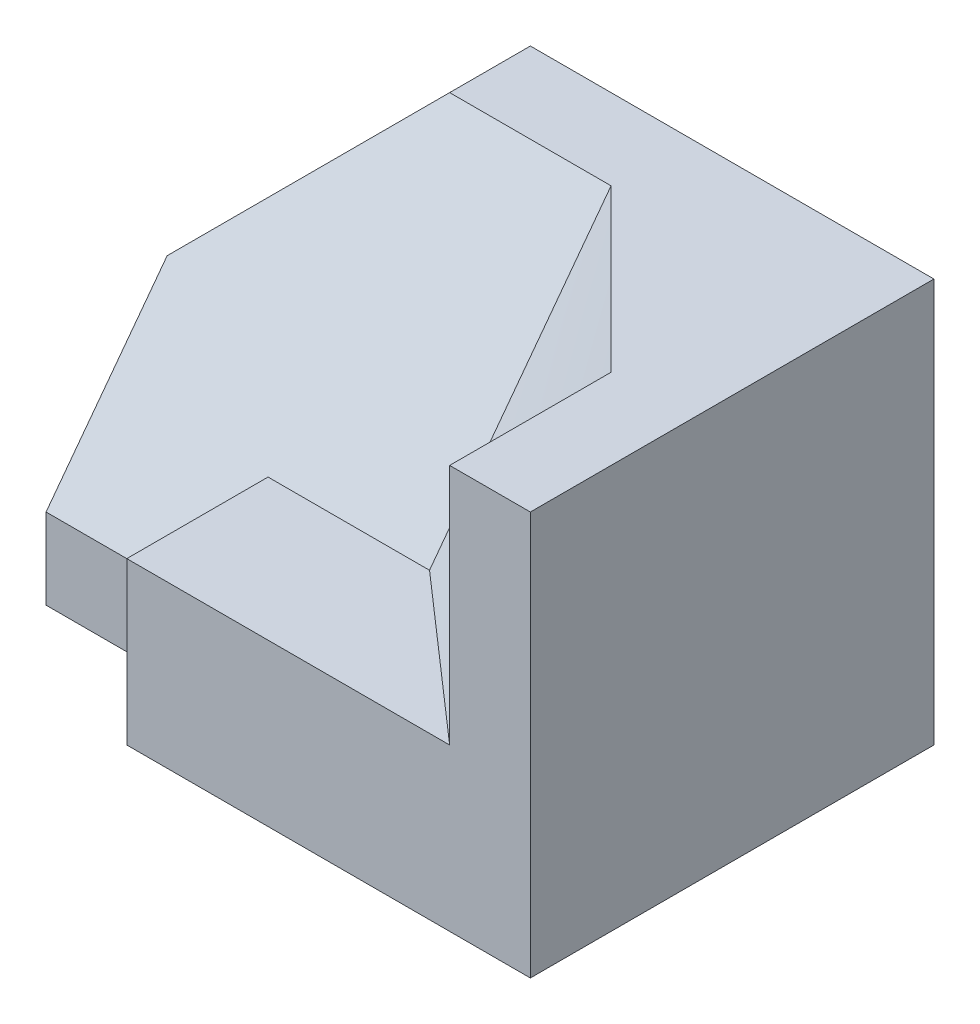
ISO-10303-21;
HEADER;
FILE_DESCRIPTION(('STEP AP214'),'2;1');
FILE_NAME('part.step','',(''),(''),'','','');
FILE_SCHEMA(('AUTOMOTIVE_DESIGN { 1 0 10303 214 1 1 1 1 }'));
ENDSEC;
DATA;
#1=APPLICATION_CONTEXT('core data for automotive mechanical design processes');
#2=APPLICATION_PROTOCOL_DEFINITION('international standard','automotive_design',2000,#1);
#3=PRODUCT_CONTEXT('',#1,'mechanical');
#4=PRODUCT('Part','Part','',(#3));
#5=PRODUCT_RELATED_PRODUCT_CATEGORY('part','',(#4));
#6=PRODUCT_DEFINITION_FORMATION('','',#4);
#7=PRODUCT_DEFINITION_CONTEXT('part definition',#1,'design');
#8=PRODUCT_DEFINITION('design','',#6,#7);
#9=PRODUCT_DEFINITION_SHAPE('','',#8);
#10=(LENGTH_UNIT() NAMED_UNIT(*) SI_UNIT(.MILLI.,.METRE.));
#11=(NAMED_UNIT(*) PLANE_ANGLE_UNIT() SI_UNIT($,.RADIAN.));
#12=(NAMED_UNIT(*) SI_UNIT($,.STERADIAN.) SOLID_ANGLE_UNIT());
#13=UNCERTAINTY_MEASURE_WITH_UNIT(LENGTH_MEASURE(1.E-05),#10,'distance_accuracy_value','');
#14=(GEOMETRIC_REPRESENTATION_CONTEXT(3) GLOBAL_UNCERTAINTY_ASSIGNED_CONTEXT((#13)) GLOBAL_UNIT_ASSIGNED_CONTEXT((#10,
#11,#12)) REPRESENTATION_CONTEXT('',''));
#15=CARTESIAN_POINT('',(0.,0.,0.));
#16=DIRECTION('',(0.,0.,1.));
#17=DIRECTION('',(1.,0.,0.));
#18=AXIS2_PLACEMENT_3D('',#15,#16,#17);
#19=CARTESIAN_POINT('',(3.5,-2.5,5.));
#20=DIRECTION('',(-1.,0.,0.));
#21=DIRECTION('',(0.,0.,1.));
#22=AXIS2_PLACEMENT_3D('',#19,#20,#21);
#23=PLANE('',#22);
#24=DIRECTION('',(0.,1.,0.));
#25=VECTOR('',#24,1.);
#26=CARTESIAN_POINT('',(3.5,-2.5,0.));
#27=LINE('',#26,#25);
#28=CARTESIAN_POINT('',(3.5,-2.5,0.));
#29=VERTEX_POINT('',#28);
#30=CARTESIAN_POINT('',(3.5,2.5,0.));
#31=VERTEX_POINT('',#30);
#32=EDGE_CURVE('E94',#29,#31,#27,.T.);
#33=ORIENTED_EDGE('',*,*,#32,.T.);
#34=DIRECTION('',(0.,0.,-1.));
#35=VECTOR('',#34,1.);
#36=CARTESIAN_POINT('',(3.5,2.5,5.));
#37=LINE('',#36,#35);
#38=CARTESIAN_POINT('',(3.5,2.5,5.));
#39=VERTEX_POINT('',#38);
#40=EDGE_CURVE('E11',#39,#31,#37,.T.);
#41=ORIENTED_EDGE('',*,*,#40,.F.);
#42=DIRECTION('',(0.,1.,0.));
#43=VECTOR('',#42,1.);
#44=CARTESIAN_POINT('',(3.5,-2.5,5.));
#45=LINE('',#44,#43);
#46=CARTESIAN_POINT('',(3.5,-2.5,5.));
#47=VERTEX_POINT('',#46);
#48=EDGE_CURVE('E88',#47,#39,#45,.T.);
#49=ORIENTED_EDGE('',*,*,#48,.F.);
#50=DIRECTION('',(0.,0.,-1.));
#51=VECTOR('',#50,1.);
#52=CARTESIAN_POINT('',(3.5,-2.5,5.));
#53=LINE('',#52,#51);
#54=EDGE_CURVE('E79',#47,#29,#53,.T.);
#55=ORIENTED_EDGE('',*,*,#54,.T.);
#56=EDGE_LOOP('',(#33,#41,#49,#55));
#57=FACE_BOUND('',#56,.T.);
#58=ADVANCED_FACE('F33',(#57),#23,.F.);
#59=CARTESIAN_POINT('',(-1.5,2.5,5.));
#60=DIRECTION('',(0.,-1.,0.));
#61=DIRECTION('',(0.,0.,-1.));
#62=AXIS2_PLACEMENT_3D('',#59,#60,#61);
#63=PLANE('',#62);
#64=DIRECTION('',(-1.,0.,0.));
#65=VECTOR('',#64,1.);
#66=CARTESIAN_POINT('',(0.5,2.5,1.));
#67=LINE('',#66,#65);
#68=CARTESIAN_POINT('',(0.499991235425581,2.50000662214534,1.00002003976787));
#69=VERTEX_POINT('',#68);
#70=CARTESIAN_POINT('',(-1.5,2.5,1.));
#71=VERTEX_POINT('',#70);
#72=EDGE_CURVE('E121',#69,#71,#67,.T.);
#73=ORIENTED_EDGE('',*,*,#72,.F.);
#74=CARTESIAN_POINT('',(2.50056026393935,2.49957668946805,2.99940238513136));
#75=CARTESIAN_POINT('',(2.4170043884305,2.49974362794372,2.91630313545304));
#76=CARTESIAN_POINT('',(2.33350648577593,2.49986806083446,2.83314559335253));
#77=CARTESIAN_POINT('',(2.16659707572382,2.50005165014215,2.66673835405384));
#78=CARTESIAN_POINT('',(2.08318557121702,2.50011080444127,2.58348865395344));
#79=CARTESIAN_POINT('',(1.91642286921159,2.50018356384401,2.41692497031433));
#80=CARTESIAN_POINT('',(1.83307167317345,2.50019716787918,2.33361098531356));
#81=CARTESIAN_POINT('',(1.66640279858282,2.5001990420842,2.16694723722489));
#82=CARTESIAN_POINT('',(1.58308512050144,2.50018731190961,2.08359747366595));
#83=CARTESIAN_POINT('',(1.41645979373729,2.50015624466314,1.91688716884527));
#84=CARTESIAN_POINT('',(1.33315214510184,2.50013690755667,1.83352662753625));
#85=CARTESIAN_POINT('',(1.16653062517446,2.50010289131271,1.66681206317689));
#86=CARTESIAN_POINT('',(1.08321675389405,2.50008821216681,1.58345804011504));
#87=CARTESIAN_POINT('',(0.916576667949463,2.50006811271476,1.41676297625748));
#88=CARTESIAN_POINT('',(0.833250453334195,2.50006269237286,1.33342193541289));
#89=CARTESIAN_POINT('',(0.666595657226337,2.50005363999642,1.166742378393));
#90=CARTESIAN_POINT('',(0.583267075736072,2.50005000796018,1.0834038622154));
#91=CARTESIAN_POINT('',(0.49994238070798,2.50004353487126,1.00006146138524));
#92=B_SPLINE_CURVE_WITH_KNOTS('',3,(#74,#75,#76,#77,#78,#79,#80,#81,#82,#83,#84,#85,#86,#87,#88,
#89,#90,#91),.UNSPECIFIED.,.F.,.F.,(4,2,2,2,2,2,2,2,4),(0.,0.35353046862066,0.707072406602181,
1.06062263744386,1.41417767518168,1.76773432056764,2.12129032681654,2.47484496762246,
2.82839927245548),.UNSPECIFIED.);
#93=CARTESIAN_POINT('',(2.50047933076574,2.49988586347262,2.99950157618049));
#94=VERTEX_POINT('',#93);
#95=EDGE_CURVE('E149',#94,#69,#92,.T.);
#96=ORIENTED_EDGE('',*,*,#95,.F.);
#97=DIRECTION('',(0.,0.,-1.));
#98=VECTOR('',#97,1.);
#99=CARTESIAN_POINT('',(2.5,2.5,3.));
#100=LINE('',#99,#98);
#101=CARTESIAN_POINT('',(2.5,2.5,5.));
#102=VERTEX_POINT('',#101);
#103=EDGE_CURVE('E134',#102,#94,#100,.T.);
#104=ORIENTED_EDGE('',*,*,#103,.F.);
#105=DIRECTION('',(-1.,0.,0.));
#106=VECTOR('',#105,1.);
#107=CARTESIAN_POINT('',(-1.5,2.5,5.));
#108=LINE('',#107,#106);
#109=EDGE_CURVE('E281',#39,#102,#108,.T.);
#110=ORIENTED_EDGE('',*,*,#109,.F.);
#111=ORIENTED_EDGE('',*,*,#40,.T.);
#112=DIRECTION('',(-1.,0.,0.));
#113=VECTOR('',#112,1.);
#114=CARTESIAN_POINT('',(-1.5,2.5,0.));
#115=LINE('',#114,#113);
#116=CARTESIAN_POINT('',(-1.5,2.5,0.));
#117=VERTEX_POINT('',#116);
#118=EDGE_CURVE('E99',#31,#117,#115,.T.);
#119=ORIENTED_EDGE('',*,*,#118,.T.);
#120=DIRECTION('',(0.,0.,-1.));
#121=VECTOR('',#120,1.);
#122=CARTESIAN_POINT('',(-1.5,2.5,5.));
#123=LINE('',#122,#121);
#124=EDGE_CURVE('E44',#71,#117,#123,.T.);
#125=ORIENTED_EDGE('',*,*,#124,.F.);
#126=EDGE_LOOP('',(#73,#96,#104,#110,#111,#119,#125));
#127=FACE_BOUND('',#126,.T.);
#128=ADVANCED_FACE('F155',(#127),#63,.F.);
#129=CARTESIAN_POINT('',(-3.5,0.5,5.));
#130=DIRECTION('',(0.707106781186548,-0.707106781186548,0.));
#131=DIRECTION('',(0.707106781186548,0.707106781186548,0.));
#132=AXIS2_PLACEMENT_3D('',#129,#130,#131);
#133=PLANE('',#132);
#134=DIRECTION('',(0.,0.,-1.));
#135=VECTOR('',#134,1.);
#136=CARTESIAN_POINT('',(-3.5,0.5,5.));
#137=LINE('',#136,#135);
#138=CARTESIAN_POINT('',(-3.5,0.5,2.5));
#139=VERTEX_POINT('',#138);
#140=CARTESIAN_POINT('',(-3.5,0.5,0.));
#141=VERTEX_POINT('',#140);
#142=EDGE_CURVE('E114',#139,#141,#137,.T.);
#143=ORIENTED_EDGE('',*,*,#142,.F.);
#144=DIRECTION('',(0.624695047554424,0.624695047554424,-0.468521285665818));
#145=VECTOR('',#144,1.);
#146=CARTESIAN_POINT('',(-4.23170731707317,-0.23170731707317,3.04878048780488));
#147=LINE('',#146,#145);
#148=EDGE_CURVE('E135',#139,#71,#147,.T.);
#149=ORIENTED_EDGE('',*,*,#148,.T.);
#150=ORIENTED_EDGE('',*,*,#124,.T.);
#151=DIRECTION('',(-0.707106781186548,-0.707106781186548,0.));
#152=VECTOR('',#151,1.);
#153=CARTESIAN_POINT('',(-3.5,0.5,0.));
#154=LINE('',#153,#152);
#155=EDGE_CURVE('E102',#117,#141,#154,.T.);
#156=ORIENTED_EDGE('',*,*,#155,.T.);
#157=EDGE_LOOP('',(#143,#149,#150,#156));
#158=FACE_BOUND('',#157,.T.);
#159=ADVANCED_FACE('F164',(#158),#133,.F.);
#160=CARTESIAN_POINT('',(-3.5,-2.5,5.));
#161=DIRECTION('',(1.,0.,0.));
#162=DIRECTION('',(0.,0.,-1.));
#163=AXIS2_PLACEMENT_3D('',#160,#161,#162);
#164=PLANE('',#163);
#165=DIRECTION('',(0.,0.,-1.));
#166=VECTOR('',#165,1.);
#167=CARTESIAN_POINT('',(-3.5,-2.5,5.));
#168=LINE('',#167,#166);
#169=CARTESIAN_POINT('',(-3.5,-2.5,4.));
#170=VERTEX_POINT('',#169);
#171=CARTESIAN_POINT('',(-3.5,-2.5,0.));
#172=VERTEX_POINT('',#171);
#173=EDGE_CURVE('E83',#170,#172,#168,.T.);
#174=ORIENTED_EDGE('',*,*,#173,.F.);
#175=DIRECTION('',(0.,-1.,0.));
#176=VECTOR('',#175,1.);
#177=CARTESIAN_POINT('',(-3.5,-2.5,4.));
#178=LINE('',#177,#176);
#179=CARTESIAN_POINT('',(-3.5,-1.5,4.));
#180=VERTEX_POINT('',#179);
#181=EDGE_CURVE('E267',#180,#170,#178,.T.);
#182=ORIENTED_EDGE('',*,*,#181,.F.);
#183=DIRECTION('',(0.,-0.8,0.6));
#184=VECTOR('',#183,1.);
#185=CARTESIAN_POINT('',(-3.5,-1.5,4.));
#186=LINE('',#185,#184);
#187=EDGE_CURVE('E120',#139,#180,#186,.T.);
#188=ORIENTED_EDGE('',*,*,#187,.F.);
#189=ORIENTED_EDGE('',*,*,#142,.T.);
#190=DIRECTION('',(0.,-1.,0.));
#191=VECTOR('',#190,1.);
#192=CARTESIAN_POINT('',(-3.5,-2.5,0.));
#193=LINE('',#192,#191);
#194=EDGE_CURVE('E89',#141,#172,#193,.T.);
#195=ORIENTED_EDGE('',*,*,#194,.T.);
#196=EDGE_LOOP('',(#174,#182,#188,#189,#195));
#197=FACE_BOUND('',#196,.T.);
#198=ADVANCED_FACE('F167',(#197),#164,.F.);
#199=CARTESIAN_POINT('',(-3.5,-2.5,5.));
#200=DIRECTION('',(0.,1.,0.));
#201=DIRECTION('',(0.,0.,1.));
#202=AXIS2_PLACEMENT_3D('',#199,#200,#201);
#203=PLANE('',#202);
#204=DIRECTION('',(0.,0.,1.));
#205=VECTOR('',#204,1.);
#206=CARTESIAN_POINT('',(-1.5,-2.5,5.));
#207=LINE('',#206,#205);
#208=CARTESIAN_POINT('',(-1.5,-2.5,4.));
#209=VERTEX_POINT('',#208);
#210=CARTESIAN_POINT('',(-1.5,-2.5,5.));
#211=VERTEX_POINT('',#210);
#212=EDGE_CURVE('E264',#209,#211,#207,.T.);
#213=ORIENTED_EDGE('',*,*,#212,.F.);
#214=DIRECTION('',(-1.,0.,0.));
#215=VECTOR('',#214,1.);
#216=CARTESIAN_POINT('',(-1.5,-2.5,4.));
#217=LINE('',#216,#215);
#218=EDGE_CURVE('E276',#209,#170,#217,.T.);
#219=ORIENTED_EDGE('',*,*,#218,.T.);
#220=ORIENTED_EDGE('',*,*,#173,.T.);
#221=DIRECTION('',(1.,0.,0.));
#222=VECTOR('',#221,1.);
#223=CARTESIAN_POINT('',(-3.5,-2.5,0.));
#224=LINE('',#223,#222);
#225=EDGE_CURVE('E75',#172,#29,#224,.T.);
#226=ORIENTED_EDGE('',*,*,#225,.T.);
#227=ORIENTED_EDGE('',*,*,#54,.F.);
#228=DIRECTION('',(1.,0.,0.));
#229=VECTOR('',#228,1.);
#230=CARTESIAN_POINT('',(-3.5,-2.5,5.));
#231=LINE('',#230,#229);
#232=EDGE_CURVE('E53',#211,#47,#231,.T.);
#233=ORIENTED_EDGE('',*,*,#232,.F.);
#234=EDGE_LOOP('',(#213,#219,#220,#226,#227,#233));
#235=FACE_BOUND('',#234,.T.);
#236=ADVANCED_FACE('F78',(#235),#203,.F.);
#237=CARTESIAN_POINT('',(0.,0.,5.));
#238=DIRECTION('',(0.,0.,-1.));
#239=DIRECTION('',(-1.,0.,0.));
#240=AXIS2_PLACEMENT_3D('',#237,#238,#239);
#241=PLANE('',#240);
#242=DIRECTION('',(-1.,0.,0.));
#243=VECTOR('',#242,1.);
#244=CARTESIAN_POINT('',(2.5,-0.5,5.));
#245=LINE('',#244,#243);
#246=CARTESIAN_POINT('',(2.49997307519267,-0.49999133696356,5.00000132953479));
#247=VERTEX_POINT('',#246);
#248=CARTESIAN_POINT('',(-1.5,-0.5,5.));
#249=VERTEX_POINT('',#248);
#250=EDGE_CURVE('E100',#247,#249,#245,.T.);
#251=ORIENTED_EDGE('',*,*,#250,.T.);
#252=DIRECTION('',(0.,1.,0.));
#253=VECTOR('',#252,1.);
#254=CARTESIAN_POINT('',(-1.5,2.5,5.));
#255=LINE('',#254,#253);
#256=EDGE_CURVE('E262',#211,#249,#255,.T.);
#257=ORIENTED_EDGE('',*,*,#256,.F.);
#258=ORIENTED_EDGE('',*,*,#232,.T.);
#259=ORIENTED_EDGE('',*,*,#48,.T.);
#260=ORIENTED_EDGE('',*,*,#109,.T.);
#261=DIRECTION('',(0.,1.,0.));
#262=VECTOR('',#261,1.);
#263=CARTESIAN_POINT('',(2.5,2.5,5.));
#264=LINE('',#263,#262);
#265=EDGE_CURVE('E131',#247,#102,#264,.T.);
#266=ORIENTED_EDGE('',*,*,#265,.F.);
#267=EDGE_LOOP('',(#251,#257,#258,#259,#260,#266));
#268=FACE_BOUND('',#267,.T.);
#269=ADVANCED_FACE('F174',(#268),#241,.F.);
#270=CARTESIAN_POINT('',(0.,0.,0.));
#271=DIRECTION('',(0.,0.,-1.));
#272=DIRECTION('',(-1.,0.,0.));
#273=AXIS2_PLACEMENT_3D('',#270,#271,#272);
#274=PLANE('',#273);
#275=ORIENTED_EDGE('',*,*,#32,.F.);
#276=ORIENTED_EDGE('',*,*,#225,.F.);
#277=ORIENTED_EDGE('',*,*,#194,.F.);
#278=ORIENTED_EDGE('',*,*,#155,.F.);
#279=ORIENTED_EDGE('',*,*,#118,.F.);
#280=EDGE_LOOP('',(#275,#276,#277,#278,#279));
#281=FACE_BOUND('',#280,.T.);
#282=ADVANCED_FACE('F96',(#281),#274,.T.);
#283=CARTESIAN_POINT('',(2.5,0.,0.));
#284=DIRECTION('',(-1.,0.,0.));
#285=DIRECTION('',(0.,0.,1.));
#286=AXIS2_PLACEMENT_3D('',#283,#284,#285);
#287=PLANE('',#286);
#288=ORIENTED_EDGE('',*,*,#265,.T.);
#289=ORIENTED_EDGE('',*,*,#103,.T.);
#290=CARTESIAN_POINT('',(2.5,2.27646734450363,3.14902177033091));
#291=CARTESIAN_POINT('',(2.50001781366081,2.28576772821382,3.14279354047899));
#292=CARTESIAN_POINT('',(2.50003627583717,2.29506763957352,3.13656460711781));
#293=CARTESIAN_POINT('',(2.50007452983351,2.31366645767341,3.1241053221088));
#294=CARTESIAN_POINT('',(2.50009432164839,2.32296536441733,3.11787497046653));
#295=CARTESIAN_POINT('',(2.50013526759095,2.34156214861091,3.10541281404249));
#296=CARTESIAN_POINT('',(2.50015642171332,2.35086002606444,3.09918100926649));
#297=CARTESIAN_POINT('',(2.50020012426825,2.36945472749928,3.0867159124459));
#298=CARTESIAN_POINT('',(2.5002226726953,2.37875155148461,3.08048262040727));
#299=CARTESIAN_POINT('',(2.50026919532671,2.3973441222088,3.06801451549589));
#300=CARTESIAN_POINT('',(2.50029316952537,2.40663986895183,3.06177970262931));
#301=CARTESIAN_POINT('',(2.50034257454055,2.42523026188897,3.0493085231659));
#302=CARTESIAN_POINT('',(2.50036800535118,2.43452490808738,3.04307215657545));
#303=CARTESIAN_POINT('',(2.50042035384696,2.45311307707737,3.03059783738875));
#304=CARTESIAN_POINT('',(2.50044727152605,2.46240659987337,3.02435988479906));
#305=CARTESIAN_POINT('',(2.50050262315592,2.48099249983803,3.01188236226313));
#306=CARTESIAN_POINT('',(2.50053105710047,2.49028487701125,3.00564279232362));
#307=CARTESIAN_POINT('',(2.50056026393935,2.49957668946805,2.99940238513136));
#308=B_SPLINE_CURVE_WITH_KNOTS('',3,(#290,#291,#292,#293,#294,#295,#296,#297,#298,#299,#300,
#301,#302,#303,#304,#305,#306,#307),.UNSPECIFIED.,.F.,.F.,(4,2,2,2,2,2,2,2,4),(0.,
0.0335796770661892,0.0671592250816058,0.100738642216832,0.134317926789757,0.167897077268778,
0.20147609227574,0.235054970588542,0.268633711143436),.UNSPECIFIED.);
#309=CARTESIAN_POINT('',(2.5,2.27646734450363,3.14902177033091));
#310=VERTEX_POINT('',#309);
#311=EDGE_CURVE('E105',#94,#310,#308,.F.);
#312=ORIENTED_EDGE('',*,*,#311,.T.);
#313=CARTESIAN_POINT('',(2.49993514931745,-0.499951001706517,5.00006917406139));
#314=CARTESIAN_POINT('',(2.49987531175543,-0.384221253069684,4.92300997543793));
#315=CARTESIAN_POINT('',(2.49988213395827,-0.268539843390887,4.84587832226686));
#316=CARTESIAN_POINT('',(2.49994508324975,-0.0372142766107061,4.69156242404457));
#317=CARTESIAN_POINT('',(2.50000120969777,0.0784298809551727,4.61437817968969));
#318=CARTESIAN_POINT('',(2.5000787558919,0.309744103270462,4.46004692190056));
#319=CARTESIAN_POINT('',(2.50010017541889,0.425414168178836,4.38289990870445));
#320=CARTESIAN_POINT('',(2.50008781625458,0.656795831318536,4.22866487507674));
#321=CARTESIAN_POINT('',(2.50005403683361,0.772507430078688,4.15157685543846));
#322=CARTESIAN_POINT('',(2.49994482946449,1.00396193128663,3.99744535064986));
#323=CARTESIAN_POINT('',(2.49986940109863,1.11970483403675,3.92040186595396));
#324=CARTESIAN_POINT('',(2.49971987339478,1.35118953324244,3.76631354702583));
#325=CARTESIAN_POINT('',(2.4996457740552,1.46693132969917,3.68926871279534));
#326=CARTESIAN_POINT('',(2.49956015724733,1.69836764861606,3.53511228361571));
#327=CARTESIAN_POINT('',(2.49954863869635,1.81406217185943,3.45800068984463));
#328=CARTESIAN_POINT('',(2.49965778662853,2.04535134537493,3.30363650482228));
#329=CARTESIAN_POINT('',(2.49977844862654,2.16094599890265,3.22638391844396));
#330=CARTESIAN_POINT('',(2.5,2.27646734450363,3.14902177033091));
#331=B_SPLINE_CURVE_WITH_KNOTS('',3,(#313,#314,#315,#316,#317,#318,#319,#320,#321,#322,#323,
#324,#325,#326,#327,#328,#329,#330),.UNSPECIFIED.,.F.,.F.,(4,2,2,2,2,2,2,2,4),(0.,
0.417113105376545,0.834220791200371,1.25133111056165,1.66844694380398,2.08556696058187,
2.50268647513714,2.91979877325739,3.33689691834255),.UNSPECIFIED.);
#332=EDGE_CURVE('E241',#310,#247,#331,.F.);
#333=ORIENTED_EDGE('',*,*,#332,.T.);
#334=EDGE_LOOP('',(#288,#289,#312,#333));
#335=FACE_BOUND('',#334,.T.);
#336=ADVANCED_FACE('F177',(#335),#287,.T.);
#337=CARTESIAN_POINT('',(-1.5,-1.5,4.));
#338=DIRECTION('',(0.,-0.6,-0.8));
#339=DIRECTION('',(0.,0.8,-0.6));
#340=AXIS2_PLACEMENT_3D('',#337,#338,#339);
#341=PLANE('',#340);
#342=ORIENTED_EDGE('',*,*,#187,.T.);
#343=DIRECTION('',(-1.,0.,0.));
#344=VECTOR('',#343,1.);
#345=CARTESIAN_POINT('',(-1.5,-1.5,4.));
#346=LINE('',#345,#344);
#347=CARTESIAN_POINT('',(-1.5,-1.5,4.));
#348=VERTEX_POINT('',#347);
#349=EDGE_CURVE('E255',#348,#180,#346,.T.);
#350=ORIENTED_EDGE('',*,*,#349,.F.);
#351=DIRECTION('',(0.,-0.8,0.6));
#352=VECTOR('',#351,1.);
#353=CARTESIAN_POINT('',(-1.5,-1.5,4.));
#354=LINE('',#353,#352);
#355=CARTESIAN_POINT('',(-1.5,-0.5,3.25));
#356=VERTEX_POINT('',#355);
#357=EDGE_CURVE('E252',#356,#348,#354,.T.);
#358=ORIENTED_EDGE('',*,*,#357,.F.);
#359=DIRECTION('',(-1.,0.,0.));
#360=VECTOR('',#359,1.);
#361=CARTESIAN_POINT('',(0.5,-0.5,3.25));
#362=LINE('',#361,#360);
#363=CARTESIAN_POINT('',(0.500402084888271,-0.500303797471138,3.24957110945251));
#364=VERTEX_POINT('',#363);
#365=EDGE_CURVE('E117',#364,#356,#362,.T.);
#366=ORIENTED_EDGE('',*,*,#365,.F.);
#367=CARTESIAN_POINT('',(0.500000000000001,-0.286544159431135,3.08990811957335));
#368=CARTESIAN_POINT('',(0.500017792600942,-0.29545158025685,3.09655962394443));
#369=CARTESIAN_POINT('',(0.500036215325512,-0.304359492924318,3.1032104679949));
#370=CARTESIAN_POINT('',(0.500074354196322,-0.322176295511297,3.11651077644615));
#371=CARTESIAN_POINT('',(0.500094070337911,-0.331085185427179,3.1231602408518));
#372=CARTESIAN_POINT('',(0.500134829270275,-0.348903967622865,3.1364577545757));
#373=CARTESIAN_POINT('',(0.500155872056207,-0.357813859898891,3.14310580389903));
#374=CARTESIAN_POINT('',(0.500199317202157,-0.375634671689825,3.15640045233718));
#375=CARTESIAN_POINT('',(0.500221719557142,-0.38454559120081,3.16304705145728));
#376=CARTESIAN_POINT('',(0.500267916520992,-0.40236848215381,3.17633876463107));
#377=CARTESIAN_POINT('',(0.500291711124638,-0.411280453591758,3.18298387869025));
#378=CARTESIAN_POINT('',(0.500340724972156,-0.429105472867837,3.19627258719636));
#379=CARTESIAN_POINT('',(0.500365944210626,-0.438018520701759,3.20291618164896));
#380=CARTESIAN_POINT('',(0.500417839437354,-0.455845717032503,3.21620181669337));
#381=CARTESIAN_POINT('',(0.500444515420032,-0.464759865524977,3.22284385729101));
#382=CARTESIAN_POINT('',(0.500499355831182,-0.482589287113548,3.2361263508109));
#383=CARTESIAN_POINT('',(0.500527520253899,-0.491504560205165,3.24276680373917));
#384=CARTESIAN_POINT('',(0.500556444803475,-0.500420424962625,3.2494064588763));
#385=B_SPLINE_CURVE_WITH_KNOTS('',3,(#367,#368,#369,#370,#371,#372,#373,#374,#375,#376,#377,
#378,#379,#380,#381,#382,#383,#384),.UNSPECIFIED.,.F.,.F.,(4,2,2,2,2,2,2,2,4),(0.,
0.033350633465913,0.0667011469935341,0.100051538776211,0.1334018071257,0.16675195047539,
0.200101967383326,0.233451856535081,0.266801616746425),.UNSPECIFIED.);
#386=CARTESIAN_POINT('',(0.500000000000001,-0.286544159431136,3.08990811957335));
#387=VERTEX_POINT('',#386);
#388=EDGE_CURVE('E219',#387,#364,#385,.T.);
#389=ORIENTED_EDGE('',*,*,#388,.F.);
#390=CARTESIAN_POINT('',(0.499942380317504,2.50004353487122,1.00006146099466));
#391=CARTESIAN_POINT('',(0.499869181527484,2.3839945024911,1.08721779330345));
#392=CARTESIAN_POINT('',(0.499870521554036,2.26788705409415,1.17429619089113));
#393=CARTESIAN_POINT('',(0.49993059379806,2.03562879430691,1.34839176773299));
#394=CARTESIAN_POINT('',(0.499989325214831,1.9194779835442,1.43540894782429));
#395=CARTESIAN_POINT('',(0.500072498099911,1.68720258700603,1.60947964618229));
#396=CARTESIAN_POINT('',(0.500096939379563,1.57107800137837,1.69653316464627));
#397=CARTESIAN_POINT('',(0.500088545453346,1.33887227223477,1.87070117158346));
#398=CARTESIAN_POINT('',(0.500055709525891,1.22279112928455,1.95781566081096));
#399=CARTESIAN_POINT('',(0.499945707033782,0.990662498697938,2.13209180448804));
#400=CARTESIAN_POINT('',(0.499868540032986,0.874615011403891,2.21925345939321));
#401=CARTESIAN_POINT('',(0.499714041152243,0.642520263649994,2.39357686838051));
#402=CARTESIAN_POINT('',(0.499636709272426,0.526473003190037,2.48073862246251));
#403=CARTESIAN_POINT('',(0.499545617183136,0.294330451111296,2.65499432026741));
#404=CARTESIAN_POINT('',(0.499531855935757,0.178235160307647,2.7420882650742));
#405=CARTESIAN_POINT('',(0.49964308068963,-0.0540602527102066,2.91612815773959));
#406=CARTESIAN_POINT('',(0.499768062143505,-0.170260371363891,3.00307411035519));
#407=CARTESIAN_POINT('',(0.500000000000001,-0.286544159431135,3.08990811957335));
#408=B_SPLINE_CURVE_WITH_KNOTS('',3,(#390,#391,#392,#393,#394,#395,#396,#397,#398,#399,#400,
#401,#402,#403,#404,#405,#406,#407),.UNSPECIFIED.,.F.,.F.,(4,2,2,2,2,2,2,2,4),(0.,
0.435399017369052,0.870791960313865,1.30618729867927,1.74158812224107,2.17699322947455,
2.61239799455775,3.04779565084041,3.48317903711768),.UNSPECIFIED.);
#409=EDGE_CURVE('E126',#69,#387,#408,.T.);
#410=ORIENTED_EDGE('',*,*,#409,.F.);
#411=ORIENTED_EDGE('',*,*,#72,.T.);
#412=ORIENTED_EDGE('',*,*,#148,.F.);
#413=EDGE_LOOP('',(#342,#350,#358,#366,#389,#410,#411,#412));
#414=FACE_BOUND('',#413,.T.);
#415=ADVANCED_FACE('F183',(#414),#341,.F.);
#416=CARTESIAN_POINT('',(-1.5,0.,0.));
#417=DIRECTION('',(1.,0.,0.));
#418=DIRECTION('',(0.,0.,-1.));
#419=AXIS2_PLACEMENT_3D('',#416,#417,#418);
#420=PLANE('',#419);
#421=ORIENTED_EDGE('',*,*,#256,.T.);
#422=DIRECTION('',(0.,0.,1.));
#423=VECTOR('',#422,1.);
#424=CARTESIAN_POINT('',(-1.5,-0.5,5.));
#425=LINE('',#424,#423);
#426=EDGE_CURVE('E245',#356,#249,#425,.T.);
#427=ORIENTED_EDGE('',*,*,#426,.F.);
#428=ORIENTED_EDGE('',*,*,#357,.T.);
#429=DIRECTION('',(0.,-1.,0.));
#430=VECTOR('',#429,1.);
#431=CARTESIAN_POINT('',(-1.5,-2.5,4.));
#432=LINE('',#431,#430);
#433=EDGE_CURVE('E261',#348,#209,#432,.T.);
#434=ORIENTED_EDGE('',*,*,#433,.T.);
#435=ORIENTED_EDGE('',*,*,#212,.T.);
#436=EDGE_LOOP('',(#421,#427,#428,#434,#435));
#437=FACE_BOUND('',#436,.T.);
#438=ADVANCED_FACE('F312',(#437),#420,.F.);
#439=CARTESIAN_POINT('',(-1.5,-2.5,4.));
#440=DIRECTION('',(0.,0.,-1.));
#441=DIRECTION('',(-1.,0.,0.));
#442=AXIS2_PLACEMENT_3D('',#439,#440,#441);
#443=PLANE('',#442);
#444=ORIENTED_EDGE('',*,*,#181,.T.);
#445=ORIENTED_EDGE('',*,*,#218,.F.);
#446=ORIENTED_EDGE('',*,*,#433,.F.);
#447=ORIENTED_EDGE('',*,*,#349,.T.);
#448=EDGE_LOOP('',(#444,#445,#446,#447));
#449=FACE_BOUND('',#448,.T.);
#450=ADVANCED_FACE('F311',(#449),#443,.F.);
#451=CARTESIAN_POINT('',(0.5,-0.5,5.));
#452=DIRECTION('',(0.,-1.,0.));
#453=DIRECTION('',(0.,0.,-1.));
#454=AXIS2_PLACEMENT_3D('',#451,#452,#453);
#455=PLANE('',#454);
#456=ORIENTED_EDGE('',*,*,#426,.T.);
#457=ORIENTED_EDGE('',*,*,#250,.F.);
#458=CARTESIAN_POINT('',(0.500556444803473,-0.500420424962624,3.24940645887629));
#459=CARTESIAN_POINT('',(0.58364339600873,-0.500232774125691,3.3225897762361));
#460=CARTESIAN_POINT('',(0.666790163363737,-0.500091910609533,3.39570519619303));
#461=CARTESIAN_POINT('',(0.833181634000036,-0.499884179515022,3.541831571364));
#462=CARTESIAN_POINT('',(0.916426341185568,-0.499817314994005,3.61484252213733));
#463=CARTESIAN_POINT('',(1.08298774287297,-0.499738014210487,3.76078753996557));
#464=CARTESIAN_POINT('',(1.16630443955502,-0.499725579658611,3.83372160453208));
#465=CARTESIAN_POINT('',(1.33297980060827,-0.499732418307417,3.97954497113193));
#466=CARTESIAN_POINT('',(1.4163384657526,-0.499751692115301,4.05243427228133));
#467=CARTESIAN_POINT('',(1.58306954604463,-0.499800600395029,4.19819828045035));
#468=CARTESIAN_POINT('',(1.66644196128185,-0.499830234937221,4.2710729873675));
#469=CARTESIAN_POINT('',(1.83317873452638,-0.499883367207129,4.41683112183638));
#470=CARTESIAN_POINT('',(1.91654309255695,-0.499906864953124,4.48971454936147));
#471=CARTESIAN_POINT('',(2.08325188004278,-0.499938708531883,4.63550290509704));
#472=CARTESIAN_POINT('',(2.16659630964602,-0.499947054480897,4.70840783313826));
#473=CARTESIAN_POINT('',(2.33327292207922,-0.499954493260005,4.85423075244893));
#474=CARTESIAN_POINT('',(2.41660510497474,-0.499953586141599,4.92714874364342));
#475=CARTESIAN_POINT('',(2.49993514931745,-0.499951001706516,5.00006917406139));
#476=B_SPLINE_CURVE_WITH_KNOTS('',3,(#458,#459,#460,#461,#462,#463,#464,#465,#466,#467,#468,
#469,#470,#471,#472,#473,#474,#475),.UNSPECIFIED.,.F.,.F.,(4,2,2,2,2,2,2,2,4),(0.,
0.332164679120867,0.664343081413928,0.996531923333839,1.32872712659774,1.66092458545645,
1.99312105487311,2.32531497555875,2.65750704733557),.UNSPECIFIED.);
#477=EDGE_CURVE('E231',#364,#247,#476,.T.);
#478=ORIENTED_EDGE('',*,*,#477,.F.);
#479=ORIENTED_EDGE('',*,*,#365,.T.);
#480=EDGE_LOOP('',(#456,#457,#478,#479));
#481=FACE_BOUND('',#480,.T.);
#482=ADVANCED_FACE('F233',(#481),#455,.F.);
#483=CARTESIAN_POINT('',(2.52615177095927,3.46944986143639,2.36291577951928));
#484=CARTESIAN_POINT('',(2.12202894694255,3.27769758651959,2.07687985995218));
#485=CARTESIAN_POINT('',(1.71554873765557,3.08772644714031,1.79335848467336));
#486=CARTESIAN_POINT('',(1.30638216762135,2.89978500254784,1.51270256085826));
#487=CARTESIAN_POINT('',(0.894788137694798,2.71367763876292,1.23463592759499));
#488=CARTESIAN_POINT('',(0.480911882572686,2.52929462290352,0.959003667873651));
#489=CARTESIAN_POINT('',(2.51872907910539,2.67456980715553,2.90541566290766));
#490=CARTESIAN_POINT('',(2.11089452087349,2.48562195364575,2.62333892650343));
#491=CARTESIAN_POINT('',(1.70085624841282,2.29833912866438,2.34361281860988));
#492=CARTESIAN_POINT('',(1.28827904024933,2.11297461065847,2.06659490879935));
#493=CARTESIAN_POINT('',(0.872793671382104,1.92980736962872,1.79267903707279));
#494=CARTESIAN_POINT('',(0.455049367821863,1.74834687925591,1.52117269568545));
#495=CARTESIAN_POINT('',(2.51710225564391,1.87531065231153,3.44173328667751));
#496=CARTESIAN_POINT('',(2.10425981667165,1.69014653091669,3.16499828972966));
#497=CARTESIAN_POINT('',(1.68919562413363,1.50666106777153,2.89063316325194));
#498=CARTESIAN_POINT('',(1.27175578315517,1.3249705390036,2.61880206177737));
#499=CARTESIAN_POINT('',(0.853233683869658,1.14409771651211,2.34812536916366));
#500=CARTESIAN_POINT('',(0.432595968326673,0.964823359637372,2.07970533389125));
#501=CARTESIAN_POINT('',(2.52389494054625,1.06969009114819,3.96907010152593));
#502=CARTESIAN_POINT('',(2.10244179779032,0.891031834834346,3.70151985528066));
#503=CARTESIAN_POINT('',(1.67910958555268,0.713793319906681,3.43597394981588));
#504=CARTESIAN_POINT('',(1.25485026581564,0.537255286200787,3.17141695901712));
#505=CARTESIAN_POINT('',(0.828842796183979,0.362038076859721,2.90872466143931));
#506=CARTESIAN_POINT('',(0.400950376322259,0.188245052136919,2.64804297744021));
#507=CARTESIAN_POINT('',(2.52117617224968,0.271255961290696,4.50655246645319));
#508=CARTESIAN_POINT('',(2.0968292089082,0.0947841471970511,4.24208896216585));
#509=CARTESIAN_POINT('',(1.67000116240434,-0.0798130707294677,3.98027194658504));
#510=CARTESIAN_POINT('',(1.23999779723229,-0.252011158995578,3.72184193758363));
#511=CARTESIAN_POINT('',(0.807666379452938,-0.422450274180616,3.46589518469667));
#512=CARTESIAN_POINT('',(0.373708107879353,-0.591660210943344,3.21168374252357));
#513=CARTESIAN_POINT('',(2.52241647452927,-0.530169466335449,5.03981182276589));
#514=CARTESIAN_POINT('',(2.09364354834986,-0.703297219618221,4.78006934550566));
#515=CARTESIAN_POINT('',(1.66244220987964,-0.874590172503485,4.52291717468898));
#516=CARTESIAN_POINT('',(1.22836377258247,-1.04370931738617,4.26883390928769));
#517=CARTESIAN_POINT('',(0.791807999311725,-1.21095669731104,4.01739313559156));
#518=CARTESIAN_POINT('',(0.3532824528973,-1.37671580419403,3.76805345324868));
#519=B_SPLINE_SURFACE_WITH_KNOTS('',5,5,((#483,#484,#485,#486,#487,#488),(#489,#490,#491,#492,
#493,#494),(#495,#496,#497,#498,#499,#500),(#501,#502,#503,#504,#505,#506),(#507,#508,#509,#510,
#511,#512),(#513,#514,#515,#516,#517,#518)),.UNSPECIFIED.,.F.,.F.,.F.,(6,6),(6,6),
(-2.441478925228,2.37027241858756),(-1.29481504218241,1.35624242490426),.UNSPECIFIED.);
#520=ORIENTED_EDGE('',*,*,#95,.T.);
#521=ORIENTED_EDGE('',*,*,#409,.T.);
#522=ORIENTED_EDGE('',*,*,#388,.T.);
#523=ORIENTED_EDGE('',*,*,#477,.T.);
#524=ORIENTED_EDGE('',*,*,#332,.F.);
#525=ORIENTED_EDGE('',*,*,#311,.F.);
#526=EDGE_LOOP('',(#520,#521,#522,#523,#524,#525));
#527=FACE_BOUND('',#526,.T.);
#528=ADVANCED_FACE('F243',(#527),#519,.F.);
#529=CLOSED_SHELL('',(#58,#128,#159,#198,#236,#269,#282,#336,#415,#438,#450,#482,#528));
#530=MANIFOLD_SOLID_BREP('B2',#529);
#531=ADVANCED_BREP_SHAPE_REPRESENTATION('',(#18,#530),#14);
#532=SHAPE_DEFINITION_REPRESENTATION(#9,#531);
ENDSEC;
END-ISO-10303-21;
